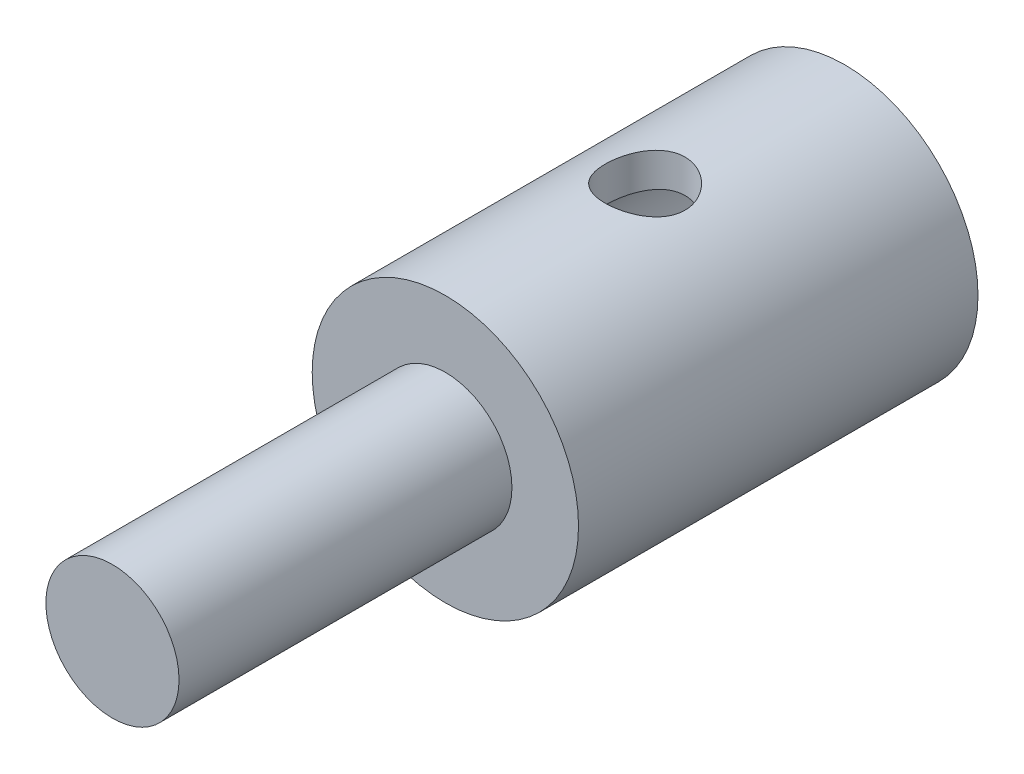
ISO-10303-21;
HEADER;
FILE_DESCRIPTION(('STEP AP214'),'2;1');
FILE_NAME('part.step','',(''),(''),'','','');
FILE_SCHEMA(('AUTOMOTIVE_DESIGN { 1 0 10303 214 1 1 1 1 }'));
ENDSEC;
DATA;
#1=APPLICATION_CONTEXT('core data for automotive mechanical design processes');
#2=APPLICATION_PROTOCOL_DEFINITION('international standard','automotive_design',2000,#1);
#3=PRODUCT_CONTEXT('',#1,'mechanical');
#4=PRODUCT('Part','Part','',(#3));
#5=PRODUCT_RELATED_PRODUCT_CATEGORY('part','',(#4));
#6=PRODUCT_DEFINITION_FORMATION('','',#4);
#7=PRODUCT_DEFINITION_CONTEXT('part definition',#1,'design');
#8=PRODUCT_DEFINITION('design','',#6,#7);
#9=PRODUCT_DEFINITION_SHAPE('','',#8);
#10=(LENGTH_UNIT() NAMED_UNIT(*) SI_UNIT(.MILLI.,.METRE.));
#11=(NAMED_UNIT(*) PLANE_ANGLE_UNIT() SI_UNIT($,.RADIAN.));
#12=(NAMED_UNIT(*) SI_UNIT($,.STERADIAN.) SOLID_ANGLE_UNIT());
#13=UNCERTAINTY_MEASURE_WITH_UNIT(LENGTH_MEASURE(1.E-05),#10,'distance_accuracy_value','');
#14=(GEOMETRIC_REPRESENTATION_CONTEXT(3) GLOBAL_UNCERTAINTY_ASSIGNED_CONTEXT((#13)) GLOBAL_UNIT_ASSIGNED_CONTEXT((#10,
#11,#12)) REPRESENTATION_CONTEXT('',''));
#15=CARTESIAN_POINT('',(0.,0.,0.));
#16=DIRECTION('',(0.,0.,1.));
#17=DIRECTION('',(1.,0.,0.));
#18=AXIS2_PLACEMENT_3D('',#15,#16,#17);
#19=CARTESIAN_POINT('',(0.,0.,5.5));
#20=DIRECTION('',(0.,0.,-1.));
#21=DIRECTION('',(-1.,0.,0.));
#22=AXIS2_PLACEMENT_3D('',#19,#20,#21);
#23=PLANE('',#22);
#24=CARTESIAN_POINT('',(0.,0.,5.5));
#25=DIRECTION('',(0.,0.,1.));
#26=DIRECTION('',(1.,0.,0.));
#27=AXIS2_PLACEMENT_3D('',#24,#25,#26);
#28=CIRCLE('',#27,1.);
#29=CARTESIAN_POINT('',(1.,0.,5.5));
#30=VERTEX_POINT('',#29);
#31=EDGE_CURVE('E10',#30,#30,#28,.T.);
#32=ORIENTED_EDGE('',*,*,#31,.T.);
#33=EDGE_LOOP('',(#32));
#34=FACE_BOUND('',#33,.T.);
#35=ADVANCED_FACE('F30',(#34),#23,.F.);
#36=CARTESIAN_POINT('',(0.,0.,5.5));
#37=DIRECTION('',(0.,0.,1.));
#38=DIRECTION('',(1.,0.,0.));
#39=AXIS2_PLACEMENT_3D('',#36,#37,#38);
#40=CYLINDRICAL_SURFACE('',#39,1.);
#41=ORIENTED_EDGE('',*,*,#31,.F.);
#42=EDGE_LOOP('',(#41));
#43=FACE_BOUND('',#42,.T.);
#44=CARTESIAN_POINT('',(0.,0.,0.5));
#45=DIRECTION('',(0.,0.,1.));
#46=DIRECTION('',(1.,0.,0.));
#47=AXIS2_PLACEMENT_3D('',#44,#45,#46);
#48=CIRCLE('',#47,1.);
#49=CARTESIAN_POINT('',(1.,0.,0.5));
#50=VERTEX_POINT('',#49);
#51=EDGE_CURVE('E42',#50,#50,#48,.T.);
#52=ORIENTED_EDGE('',*,*,#51,.T.);
#53=EDGE_LOOP('',(#52));
#54=FACE_BOUND('',#53,.T.);
#55=ADVANCED_FACE('F90',(#43,#54),#40,.T.);
#56=CARTESIAN_POINT('',(0.,1.,0.5));
#57=DIRECTION('',(0.,0.,-1.));
#58=DIRECTION('',(-1.,0.,0.));
#59=AXIS2_PLACEMENT_3D('',#56,#57,#58);
#60=PLANE('',#59);
#61=ORIENTED_EDGE('',*,*,#51,.F.);
#62=EDGE_LOOP('',(#61));
#63=FACE_BOUND('',#62,.T.);
#64=CARTESIAN_POINT('',(0.,0.,0.5));
#65=DIRECTION('',(0.,0.,1.));
#66=DIRECTION('',(1.,0.,0.));
#67=AXIS2_PLACEMENT_3D('',#64,#65,#66);
#68=CIRCLE('',#67,2.);
#69=CARTESIAN_POINT('',(2.,0.,0.5));
#70=VERTEX_POINT('',#69);
#71=EDGE_CURVE('E47',#70,#70,#68,.T.);
#72=ORIENTED_EDGE('',*,*,#71,.T.);
#73=EDGE_LOOP('',(#72));
#74=FACE_BOUND('',#73,.T.);
#75=ADVANCED_FACE('F86',(#63,#74),#60,.F.);
#76=CARTESIAN_POINT('',(0.,0.,5.5));
#77=DIRECTION('',(0.,0.,1.));
#78=DIRECTION('',(1.,0.,0.));
#79=AXIS2_PLACEMENT_3D('',#76,#77,#78);
#80=CYLINDRICAL_SURFACE('',#79,2.);
#81=CARTESIAN_POINT('',(0.,-2.,-1.9));
#82=CARTESIAN_POINT('',(0.03291544510132,-1.9999997170022,-1.90000039899395));
#83=CARTESIAN_POINT('',(0.0658349273406118,-1.99917966277583,-1.90271754544959));
#84=CARTESIAN_POINT('',(0.130715250121952,-1.99598842237475,-1.91348854168884));
#85=CARTESIAN_POINT('',(0.162675801764568,-1.99361677355871,-1.92154398320933));
#86=CARTESIAN_POINT('',(0.224693083101811,-1.9875822100074,-1.94269840676411));
#87=CARTESIAN_POINT('',(0.25475254575815,-1.98392120100191,-1.95578994784758));
#88=CARTESIAN_POINT('',(0.312249672421251,-1.97568843695037,-1.98661443722233));
#89=CARTESIAN_POINT('',(0.339686986987863,-1.97111656076748,-2.00434800295814));
#90=CARTESIAN_POINT('',(0.391948718873502,-1.96140294877191,-2.0444896029891));
#91=CARTESIAN_POINT('',(0.416687228497752,-1.9562495346312,-2.06700665035448));
#92=CARTESIAN_POINT('',(0.462099683693279,-1.94602333683871,-2.11584369196396));
#93=CARTESIAN_POINT('',(0.482772945309704,-1.94095056688659,-2.14216432484956));
#94=CARTESIAN_POINT('',(0.51992015089489,-1.93133645598676,-2.19858830121547));
#95=CARTESIAN_POINT('',(0.53628923608908,-1.92680962669952,-2.22876338439792));
#96=CARTESIAN_POINT('',(0.563685579098815,-1.91897448153211,-2.2915957016905));
#97=CARTESIAN_POINT('',(0.574714119679048,-1.91566587308889,-2.32425233756513));
#98=CARTESIAN_POINT('',(0.590806534730252,-1.91076348351385,-2.39015610645326));
#99=CARTESIAN_POINT('',(0.596028784940188,-1.90912427788711,-2.42336109755742));
#100=CARTESIAN_POINT('',(0.600854922460317,-1.90761115958514,-2.4902132625011));
#101=CARTESIAN_POINT('',(0.600460171044287,-1.90773681919679,-2.52386032722981));
#102=CARTESIAN_POINT('',(0.594187908798803,-1.90969897612233,-2.58935356344235));
#103=CARTESIAN_POINT('',(0.588508821050622,-1.91147355435668,-2.62122090014461));
#104=CARTESIAN_POINT('',(0.572149681708343,-1.91643342495439,-2.68352791450966));
#105=CARTESIAN_POINT('',(0.561469136566596,-1.91961885654016,-2.71396745094981));
#106=CARTESIAN_POINT('',(0.535264106614694,-1.92709093228899,-2.77304013986422));
#107=CARTESIAN_POINT('',(0.519675267738561,-1.93139206446088,-2.80164283358208));
#108=CARTESIAN_POINT('',(0.484140890354742,-1.94060394800318,-2.8558928088041));
#109=CARTESIAN_POINT('',(0.464194296010356,-1.94551484698876,-2.88153937176552));
#110=CARTESIAN_POINT('',(0.419525163062183,-1.95564404519092,-2.9302744763048));
#111=CARTESIAN_POINT('',(0.394637962986788,-1.96086661724177,-2.95321146561187));
#112=CARTESIAN_POINT('',(0.341305303725588,-1.97084897625326,-2.9946215936257));
#113=CARTESIAN_POINT('',(0.312859620744355,-1.9756087340737,-3.01309445136577));
#114=CARTESIAN_POINT('',(0.252942015337121,-1.98417264027782,-3.04514396898589));
#115=CARTESIAN_POINT('',(0.22145109989918,-1.98797017467324,-3.05868700649994));
#116=CARTESIAN_POINT('',(0.156498166241408,-1.9941340873289,-3.08023983603985));
#117=CARTESIAN_POINT('',(0.123036700635833,-1.996500864748,-3.088251171413));
#118=CARTESIAN_POINT('',(0.0563808970673328,-1.99947345857415,-3.09826087115976));
#119=CARTESIAN_POINT('',(0.0232200390404747,-2.00013940167117,-3.10046463432064));
#120=CARTESIAN_POINT('',(-0.0429998423293526,-1.99981169296703,-3.09937233771517));
#121=CARTESIAN_POINT('',(-0.0760588786763108,-1.99881826271098,-3.09607701213943));
#122=CARTESIAN_POINT('',(-0.14036144212388,-1.99532278794869,-3.0842461555554));
#123=CARTESIAN_POINT('',(-0.171629109045672,-1.99285531919782,-3.07583064496764));
#124=CARTESIAN_POINT('',(-0.232301855581804,-1.98669739136598,-3.05414270688873));
#125=CARTESIAN_POINT('',(-0.261706710810217,-1.98300678528377,-3.0408696955849));
#126=CARTESIAN_POINT('',(-0.318574875784438,-1.97467861740588,-3.0094987338075));
#127=CARTESIAN_POINT('',(-0.345977530479931,-1.97002112332088,-2.99129626362064));
#128=CARTESIAN_POINT('',(-0.397409323191996,-1.96029387505509,-2.95071009837904));
#129=CARTESIAN_POINT('',(-0.421437612942137,-1.95522401771617,-2.92832535524556));
#130=CARTESIAN_POINT('',(-0.466342978204352,-1.94501268748499,-2.87904507665161));
#131=CARTESIAN_POINT('',(-0.487073924926943,-1.93987530016511,-2.85201524968884));
#132=CARTESIAN_POINT('',(-0.523715980287685,-1.93030606092181,-2.79474882439705));
#133=CARTESIAN_POINT('',(-0.539627215314416,-1.92587419049889,-2.76451231018591));
#134=CARTESIAN_POINT('',(-0.566069388510893,-1.91826875857973,-2.7017870034919));
#135=CARTESIAN_POINT('',(-0.576625387759089,-1.91508935181965,-2.66930952535736));
#136=CARTESIAN_POINT('',(-0.592086923271644,-1.91036637789379,-2.60292481239779));
#137=CARTESIAN_POINT('',(-0.596994395917994,-1.90882225014947,-2.56901807167547));
#138=CARTESIAN_POINT('',(-0.600887937937676,-1.90759988987286,-2.5022553926552));
#139=CARTESIAN_POINT('',(-0.600112221233274,-1.90784658974116,-2.46941453959449));
#140=CARTESIAN_POINT('',(-0.593230021779939,-1.90999760518304,-2.40435435864936));
#141=CARTESIAN_POINT('',(-0.587123752499047,-1.91190185437816,-2.37213500592905));
#142=CARTESIAN_POINT('',(-0.569907555216364,-1.91710305467369,-2.30962184034326));
#143=CARTESIAN_POINT('',(-0.558860702028225,-1.92038241818175,-2.27930908505543));
#144=CARTESIAN_POINT('',(-0.532126028484565,-1.92796111563865,-2.2209430244728));
#145=CARTESIAN_POINT('',(-0.516437319851518,-1.93226064477782,-2.19289015294367));
#146=CARTESIAN_POINT('',(-0.480195055220275,-1.94159070570274,-2.13873475338919));
#147=CARTESIAN_POINT('',(-0.459485104371971,-1.94664216065503,-2.11274049549584));
#148=CARTESIAN_POINT('',(-0.414069738519131,-1.95680528180026,-2.06451900067685));
#149=CARTESIAN_POINT('',(-0.389363286853802,-1.96191696329566,-2.0422927442129));
#150=CARTESIAN_POINT('',(-0.335786304873299,-1.97180374628255,-2.00159063508199));
#151=CARTESIAN_POINT('',(-0.306815154316243,-1.97656463906268,-1.98324342125781));
#152=CARTESIAN_POINT('',(-0.246056549593412,-1.98504272182326,-1.95170593203839));
#153=CARTESIAN_POINT('',(-0.214270421199582,-1.98876039972427,-1.9385132446902));
#154=CARTESIAN_POINT('',(-0.152303085062113,-1.9944086998772,-1.9188418897389));
#155=CARTESIAN_POINT('',(-0.122314784781694,-1.99648810952427,-1.9117953308467));
#156=CARTESIAN_POINT('',(-0.0615520780923119,-1.99928377797797,-1.90237458990337));
#157=CARTESIAN_POINT('',(-0.0307778039432559,-2.00000026461896,-1.89999962691807));
#158=CARTESIAN_POINT('',(0.,-2.,-1.9));
#159=B_SPLINE_CURVE_WITH_KNOTS('',3,(#81,#82,#83,#84,#85,#86,#87,#88,#89,#90,#91,#92,#93,#94,
#95,#96,#97,#98,#99,#100,#101,#102,#103,#104,#105,#106,#107,#108,#109,#110,#111,#112,#113,#114,
#115,#116,#117,#118,#119,#120,#121,#122,#123,#124,#125,#126,#127,#128,#129,#130,#131,#132,#133,
#134,#135,#136,#137,#138,#139,#140,#141,#142,#143,#144,#145,#146,#147,#148,#149,#150,#151,#152,
#153,#154,#155,#156,#157,#158),.UNSPECIFIED.,.T.,.F.,(4,2,2,2,2,2,2,2,2,2,2,2,2,2,2,2,2,2,2,2,2,
2,2,2,2,2,2,2,2,2,2,2,2,2,2,2,2,2,4),(0.,0.0986332814450441,0.1972959859384,0.29581347052035,
0.39434406576508,0.495422411792766,0.596517749154532,0.699885924016436,0.803229258172894,
0.903678757411506,1.00410391324614,1.10090406676049,1.19771377460179,1.29584970575826,
1.39400944060401,1.49626841616245,1.59853382609407,1.70148418749654,1.80440581408502,
1.90363523772396,2.00285141417109,2.09982698669909,2.1968142183447,2.29604522278142,
2.39530112797055,2.49816160126106,2.60101937698051,2.70339125976521,2.80572803779072,
2.90380062181736,3.00186927859599,3.09872016156048,3.19558959016202,3.29598770266932,
3.3964118995396,3.49977198457628,3.60308364633053,3.69532676767143,3.78755446774509),.UNSPECIFIED.);
#160=CARTESIAN_POINT('',(0.,-2.,-1.9));
#161=VERTEX_POINT('',#160);
#162=EDGE_CURVE('E76',#161,#161,#159,.T.);
#163=ORIENTED_EDGE('',*,*,#162,.T.);
#164=EDGE_LOOP('',(#163));
#165=FACE_BOUND('',#164,.T.);
#166=CARTESIAN_POINT('',(0.,2.,-1.9));
#167=CARTESIAN_POINT('',(-0.03291544510132,1.9999997170022,-1.90000039899395));
#168=CARTESIAN_POINT('',(-0.0658349273406118,1.99917966277583,-1.90271754544959));
#169=CARTESIAN_POINT('',(-0.130715250121952,1.99598842237475,-1.91348854168884));
#170=CARTESIAN_POINT('',(-0.162675801764568,1.99361677355871,-1.92154398320933));
#171=CARTESIAN_POINT('',(-0.224693083101811,1.9875822100074,-1.94269840676411));
#172=CARTESIAN_POINT('',(-0.25475254575815,1.98392120100191,-1.95578994784758));
#173=CARTESIAN_POINT('',(-0.312249672421251,1.97568843695037,-1.98661443722233));
#174=CARTESIAN_POINT('',(-0.339686986987863,1.97111656076748,-2.00434800295814));
#175=CARTESIAN_POINT('',(-0.391948718873502,1.96140294877191,-2.0444896029891));
#176=CARTESIAN_POINT('',(-0.416687228497752,1.9562495346312,-2.06700665035448));
#177=CARTESIAN_POINT('',(-0.462099683693279,1.94602333683871,-2.11584369196396));
#178=CARTESIAN_POINT('',(-0.482772945309704,1.94095056688659,-2.14216432484956));
#179=CARTESIAN_POINT('',(-0.51992015089489,1.93133645598676,-2.19858830121547));
#180=CARTESIAN_POINT('',(-0.53628923608908,1.92680962669952,-2.22876338439792));
#181=CARTESIAN_POINT('',(-0.563685579098815,1.91897448153211,-2.2915957016905));
#182=CARTESIAN_POINT('',(-0.574714119679048,1.91566587308889,-2.32425233756513));
#183=CARTESIAN_POINT('',(-0.590806534730252,1.91076348351385,-2.39015610645326));
#184=CARTESIAN_POINT('',(-0.596028784940188,1.90912427788711,-2.42336109755742));
#185=CARTESIAN_POINT('',(-0.600854922460317,1.90761115958514,-2.4902132625011));
#186=CARTESIAN_POINT('',(-0.600460171044287,1.90773681919679,-2.52386032722981));
#187=CARTESIAN_POINT('',(-0.594187908798803,1.90969897612233,-2.58935356344235));
#188=CARTESIAN_POINT('',(-0.588508821050622,1.91147355435668,-2.62122090014461));
#189=CARTESIAN_POINT('',(-0.572149681708343,1.91643342495439,-2.68352791450966));
#190=CARTESIAN_POINT('',(-0.561469136566596,1.91961885654016,-2.71396745094981));
#191=CARTESIAN_POINT('',(-0.535264106614694,1.92709093228899,-2.77304013986422));
#192=CARTESIAN_POINT('',(-0.519675267738561,1.93139206446088,-2.80164283358208));
#193=CARTESIAN_POINT('',(-0.484140890354742,1.94060394800318,-2.8558928088041));
#194=CARTESIAN_POINT('',(-0.464194296010356,1.94551484698876,-2.88153937176552));
#195=CARTESIAN_POINT('',(-0.419525163062183,1.95564404519092,-2.9302744763048));
#196=CARTESIAN_POINT('',(-0.394637962986788,1.96086661724177,-2.95321146561187));
#197=CARTESIAN_POINT('',(-0.341305303725588,1.97084897625326,-2.9946215936257));
#198=CARTESIAN_POINT('',(-0.312859620744355,1.9756087340737,-3.01309445136577));
#199=CARTESIAN_POINT('',(-0.252942015337121,1.98417264027782,-3.04514396898589));
#200=CARTESIAN_POINT('',(-0.22145109989918,1.98797017467324,-3.05868700649994));
#201=CARTESIAN_POINT('',(-0.156498166241408,1.9941340873289,-3.08023983603985));
#202=CARTESIAN_POINT('',(-0.123036700635833,1.996500864748,-3.088251171413));
#203=CARTESIAN_POINT('',(-0.0563808970673328,1.99947345857415,-3.09826087115976));
#204=CARTESIAN_POINT('',(-0.0232200390404747,2.00013940167117,-3.10046463432064));
#205=CARTESIAN_POINT('',(0.0429998423293526,1.99981169296703,-3.09937233771517));
#206=CARTESIAN_POINT('',(0.0760588786763108,1.99881826271098,-3.09607701213943));
#207=CARTESIAN_POINT('',(0.14036144212388,1.99532278794869,-3.0842461555554));
#208=CARTESIAN_POINT('',(0.171629109045672,1.99285531919782,-3.07583064496764));
#209=CARTESIAN_POINT('',(0.232301855581804,1.98669739136598,-3.05414270688873));
#210=CARTESIAN_POINT('',(0.261706710810217,1.98300678528377,-3.0408696955849));
#211=CARTESIAN_POINT('',(0.318574875784438,1.97467861740588,-3.0094987338075));
#212=CARTESIAN_POINT('',(0.345977530479931,1.97002112332088,-2.99129626362064));
#213=CARTESIAN_POINT('',(0.397409323191996,1.96029387505509,-2.95071009837904));
#214=CARTESIAN_POINT('',(0.421437612942137,1.95522401771617,-2.92832535524556));
#215=CARTESIAN_POINT('',(0.466342978204352,1.94501268748499,-2.87904507665161));
#216=CARTESIAN_POINT('',(0.487073924926943,1.93987530016511,-2.85201524968884));
#217=CARTESIAN_POINT('',(0.523715980287685,1.93030606092181,-2.79474882439705));
#218=CARTESIAN_POINT('',(0.539627215314416,1.92587419049889,-2.76451231018591));
#219=CARTESIAN_POINT('',(0.566069388510893,1.91826875857973,-2.7017870034919));
#220=CARTESIAN_POINT('',(0.576625387759089,1.91508935181965,-2.66930952535736));
#221=CARTESIAN_POINT('',(0.592086923271644,1.91036637789379,-2.60292481239779));
#222=CARTESIAN_POINT('',(0.596994395917994,1.90882225014947,-2.56901807167547));
#223=CARTESIAN_POINT('',(0.600887937937676,1.90759988987286,-2.5022553926552));
#224=CARTESIAN_POINT('',(0.600112221233274,1.90784658974116,-2.46941453959449));
#225=CARTESIAN_POINT('',(0.593230021779939,1.90999760518304,-2.40435435864936));
#226=CARTESIAN_POINT('',(0.587123752499047,1.91190185437816,-2.37213500592905));
#227=CARTESIAN_POINT('',(0.569907555216364,1.91710305467369,-2.30962184034326));
#228=CARTESIAN_POINT('',(0.558860702028225,1.92038241818175,-2.27930908505543));
#229=CARTESIAN_POINT('',(0.532126028484565,1.92796111563865,-2.2209430244728));
#230=CARTESIAN_POINT('',(0.516437319851518,1.93226064477782,-2.19289015294367));
#231=CARTESIAN_POINT('',(0.480195055220275,1.94159070570274,-2.13873475338919));
#232=CARTESIAN_POINT('',(0.459485104371971,1.94664216065503,-2.11274049549584));
#233=CARTESIAN_POINT('',(0.414069738519131,1.95680528180026,-2.06451900067685));
#234=CARTESIAN_POINT('',(0.389363286853802,1.96191696329566,-2.0422927442129));
#235=CARTESIAN_POINT('',(0.335786304873299,1.97180374628255,-2.00159063508199));
#236=CARTESIAN_POINT('',(0.306815154316243,1.97656463906268,-1.98324342125781));
#237=CARTESIAN_POINT('',(0.246056549593412,1.98504272182326,-1.95170593203839));
#238=CARTESIAN_POINT('',(0.214270421199582,1.98876039972427,-1.9385132446902));
#239=CARTESIAN_POINT('',(0.152303085062113,1.9944086998772,-1.9188418897389));
#240=CARTESIAN_POINT('',(0.122314784781694,1.99648810952427,-1.9117953308467));
#241=CARTESIAN_POINT('',(0.0615520780923119,1.99928377797797,-1.90237458990337));
#242=CARTESIAN_POINT('',(0.0307778039432559,2.00000026461896,-1.89999962691807));
#243=CARTESIAN_POINT('',(0.,2.,-1.9));
#244=B_SPLINE_CURVE_WITH_KNOTS('',3,(#166,#167,#168,#169,#170,#171,#172,#173,#174,#175,#176,
#177,#178,#179,#180,#181,#182,#183,#184,#185,#186,#187,#188,#189,#190,#191,#192,#193,#194,#195,
#196,#197,#198,#199,#200,#201,#202,#203,#204,#205,#206,#207,#208,#209,#210,#211,#212,#213,#214,
#215,#216,#217,#218,#219,#220,#221,#222,#223,#224,#225,#226,#227,#228,#229,#230,#231,#232,#233,
#234,#235,#236,#237,#238,#239,#240,#241,#242,#243),.UNSPECIFIED.,.T.,.F.,(4,2,2,2,2,2,2,2,2,2,2,
2,2,2,2,2,2,2,2,2,2,2,2,2,2,2,2,2,2,2,2,2,2,2,2,2,2,2,4),(0.,0.0986332814450441,0.1972959859384,
0.29581347052035,0.39434406576508,0.495422411792766,0.596517749154532,0.699885924016436,
0.803229258172894,0.903678757411506,1.00410391324614,1.10090406676049,1.19771377460179,
1.29584970575826,1.39400944060401,1.49626841616245,1.59853382609407,1.70148418749654,
1.80440581408502,1.90363523772396,2.00285141417109,2.09982698669909,2.1968142183447,
2.29604522278142,2.39530112797055,2.49816160126106,2.60101937698051,2.70339125976521,
2.80572803779072,2.90380062181736,3.00186927859599,3.09872016156048,3.19558959016202,
3.29598770266932,3.3964118995396,3.49977198457628,3.60308364633053,3.69532676767143,
3.78755446774509),.UNSPECIFIED.);
#245=CARTESIAN_POINT('',(0.,2.,-1.9));
#246=VERTEX_POINT('',#245);
#247=EDGE_CURVE('E70',#246,#246,#244,.T.);
#248=ORIENTED_EDGE('',*,*,#247,.T.);
#249=EDGE_LOOP('',(#248));
#250=FACE_BOUND('',#249,.T.);
#251=ORIENTED_EDGE('',*,*,#71,.F.);
#252=EDGE_LOOP('',(#251));
#253=FACE_BOUND('',#252,.T.);
#254=CARTESIAN_POINT('',(0.,0.,-5.5));
#255=DIRECTION('',(0.,0.,1.));
#256=DIRECTION('',(1.,0.,0.));
#257=AXIS2_PLACEMENT_3D('',#254,#255,#256);
#258=CIRCLE('',#257,2.);
#259=CARTESIAN_POINT('',(2.,0.,-5.5));
#260=VERTEX_POINT('',#259);
#261=EDGE_CURVE('E103',#260,#260,#258,.T.);
#262=ORIENTED_EDGE('',*,*,#261,.T.);
#263=EDGE_LOOP('',(#262));
#264=FACE_BOUND('',#263,.T.);
#265=ADVANCED_FACE('F81',(#165,#250,#253,#264),#80,.T.);
#266=CARTESIAN_POINT('',(0.,2.,-5.5));
#267=DIRECTION('',(0.,0.,1.));
#268=DIRECTION('',(1.,0.,0.));
#269=AXIS2_PLACEMENT_3D('',#266,#267,#268);
#270=PLANE('',#269);
#271=ORIENTED_EDGE('',*,*,#261,.F.);
#272=EDGE_LOOP('',(#271));
#273=FACE_BOUND('',#272,.T.);
#274=CARTESIAN_POINT('',(0.,0.,-5.5));
#275=DIRECTION('',(0.,0.,1.));
#276=DIRECTION('',(1.,0.,0.));
#277=AXIS2_PLACEMENT_3D('',#274,#275,#276);
#278=CIRCLE('',#277,1.5);
#279=CARTESIAN_POINT('',(1.5,0.,-5.5));
#280=VERTEX_POINT('',#279);
#281=EDGE_CURVE('E105',#280,#280,#278,.T.);
#282=ORIENTED_EDGE('',*,*,#281,.T.);
#283=EDGE_LOOP('',(#282));
#284=FACE_BOUND('',#283,.T.);
#285=ADVANCED_FACE('F85',(#273,#284),#270,.F.);
#286=CARTESIAN_POINT('',(0.,0.,5.5));
#287=DIRECTION('',(0.,0.,1.));
#288=DIRECTION('',(1.,0.,0.));
#289=AXIS2_PLACEMENT_3D('',#286,#287,#288);
#290=CYLINDRICAL_SURFACE('',#289,1.5);
#291=CARTESIAN_POINT('',(0.,-1.5,-1.9));
#292=CARTESIAN_POINT('',(-0.0322479016328674,-1.49999781368125,-1.90000295554712));
#293=CARTESIAN_POINT('',(-0.0645517692272019,-1.4989478829208,-1.90261532562651));
#294=CARTESIAN_POINT('',(-0.128248944125369,-1.49485035930193,-1.91297431105637));
#295=CARTESIAN_POINT('',(-0.159639533268374,-1.49179733609663,-1.92073488372584));
#296=CARTESIAN_POINT('',(-0.220486176818221,-1.48402262763936,-1.94106282341765));
#297=CARTESIAN_POINT('',(-0.249948198485087,-1.47930640909222,-1.95361445386502));
#298=CARTESIAN_POINT('',(-0.30632159109851,-1.46866983238823,-1.98310575199796));
#299=CARTESIAN_POINT('',(-0.333233843025297,-1.46274989237417,-2.00004389647568));
#300=CARTESIAN_POINT('',(-0.385050302271118,-1.44999265851126,-2.03867064956828));
#301=CARTESIAN_POINT('',(-0.409818681765064,-1.44312689078757,-2.06053199687208));
#302=CARTESIAN_POINT('',(-0.455452501435416,-1.42938173071858,-2.10802000104303));
#303=CARTESIAN_POINT('',(-0.476316032140059,-1.42250233336138,-2.13364848916352));
#304=CARTESIAN_POINT('',(-0.514462370187863,-1.40916837539141,-2.18932842107268));
#305=CARTESIAN_POINT('',(-0.531544494358642,-1.40274634789485,-2.21952594580696));
#306=CARTESIAN_POINT('',(-0.560326415711144,-1.39150094156038,-2.28266091952601));
#307=CARTESIAN_POINT('',(-0.57202876928575,-1.38667680373253,-2.31559705835451));
#308=CARTESIAN_POINT('',(-0.58916964701876,-1.37947907298246,-2.38171370007763));
#309=CARTESIAN_POINT('',(-0.594868189741694,-1.37700426106682,-2.41481537067286));
#310=CARTESIAN_POINT('',(-0.600651888492009,-1.37449201214743,-2.48159049949218));
#311=CARTESIAN_POINT('',(-0.600739804893967,-1.37445337656831,-2.5152636683875));
#312=CARTESIAN_POINT('',(-0.595496810251363,-1.37673150083998,-2.57972700143741));
#313=CARTESIAN_POINT('',(-0.590542594291541,-1.37888452511535,-2.61055471432271));
#314=CARTESIAN_POINT('',(-0.575984064089346,-1.38502856282351,-2.67089786680201));
#315=CARTESIAN_POINT('',(-0.566378938441389,-1.38901989696502,-2.70041307643309));
#316=CARTESIAN_POINT('',(-0.542608419765322,-1.39847845526559,-2.75800535085881));
#317=CARTESIAN_POINT('',(-0.528353958694595,-1.40397413784236,-2.78604077171641));
#318=CARTESIAN_POINT('',(-0.495751938219664,-1.41581434916967,-2.83942474490847));
#319=CARTESIAN_POINT('',(-0.477402841530253,-1.42215919637055,-2.86477228282084));
#320=CARTESIAN_POINT('',(-0.43546517983633,-1.43558021022681,-2.9141229186406));
#321=CARTESIAN_POINT('',(-0.411581238891191,-1.44267499492846,-2.9378706188338));
#322=CARTESIAN_POINT('',(-0.360094328229058,-1.45637947487485,-2.98110534340061));
#323=CARTESIAN_POINT('',(-0.33249061960033,-1.46298907333597,-3.00059151922309));
#324=CARTESIAN_POINT('',(-0.273623295781753,-1.47514404379365,-3.03508523422475));
#325=CARTESIAN_POINT('',(-0.242298147403943,-1.48066581028625,-3.04999668435912));
#326=CARTESIAN_POINT('',(-0.177307129644865,-1.48984448498628,-3.07425035832342));
#327=CARTESIAN_POINT('',(-0.143642459054903,-1.49350234038714,-3.08359541126722));
#328=CARTESIAN_POINT('',(-0.0770687662823457,-1.49836841852074,-3.09593448862591));
#329=CARTESIAN_POINT('',(-0.0442329881956591,-1.49970883750057,-3.09927173627606));
#330=CARTESIAN_POINT('',(0.0215535929423437,-1.50020543553187,-3.10051393015859));
#331=CARTESIAN_POINT('',(0.0545043639671719,-1.49936218074679,-3.09842028446426));
#332=CARTESIAN_POINT('',(0.118029821736601,-1.49567270119134,-3.08911247423439));
#333=CARTESIAN_POINT('',(0.14864474753266,-1.49291817403686,-3.08213260589467));
#334=CARTESIAN_POINT('',(0.208240628418216,-1.48577832421621,-3.06356928750709));
#335=CARTESIAN_POINT('',(0.237221373067387,-1.4813927920685,-3.05198524609952));
#336=CARTESIAN_POINT('',(0.293723635745078,-1.47124978431356,-3.02416451809588));
#337=CARTESIAN_POINT('',(0.321173406826879,-1.46545444794366,-3.00779635838655));
#338=CARTESIAN_POINT('',(0.373033077373709,-1.45312009423233,-2.97101790282881));
#339=CARTESIAN_POINT('',(0.397441752227376,-1.44658077931494,-2.9506059871251));
#340=CARTESIAN_POINT('',(0.44421691290967,-1.43293535293125,-2.9047389961131));
#341=CARTESIAN_POINT('',(0.46634218014576,-1.42582032434024,-2.87903993754041));
#342=CARTESIAN_POINT('',(0.506025359220172,-1.4122250186863,-2.82416797510492));
#343=CARTESIAN_POINT('',(0.52358251838651,-1.40574484633605,-2.79499449992693));
#344=CARTESIAN_POINT('',(0.553742250590837,-1.39414289997032,-2.73356149159978));
#345=CARTESIAN_POINT('',(0.56629517841029,-1.3890348935785,-2.70127480014192));
#346=CARTESIAN_POINT('',(0.585688865962333,-1.38097102135267,-2.63477990438705));
#347=CARTESIAN_POINT('',(0.592533841593995,-1.37801356732559,-2.60057313822623));
#348=CARTESIAN_POINT('',(0.599914685172235,-1.37481527767886,-2.53386162948679));
#349=CARTESIAN_POINT('',(0.60086912468784,-1.3743942629654,-2.50141154812712));
#350=CARTESIAN_POINT('',(0.597540947786276,-1.3758445081584,-2.43683654268089));
#351=CARTESIAN_POINT('',(0.593258996374929,-1.37771547698992,-2.40471157782788));
#352=CARTESIAN_POINT('',(0.579921409845332,-1.38337994722213,-2.34300034304478));
#353=CARTESIAN_POINT('',(0.571061248071088,-1.38709449547834,-2.31336391767045));
#354=CARTESIAN_POINT('',(0.549001634547508,-1.3959720037021,-2.25598641111561));
#355=CARTESIAN_POINT('',(0.5358009844182,-1.40113536361912,-2.22824585592996));
#356=CARTESIAN_POINT('',(0.504561828827859,-1.41269582881231,-2.17371711421887));
#357=CARTESIAN_POINT('',(0.486289600547831,-1.41914664693941,-2.14707439896088));
#358=CARTESIAN_POINT('',(0.445767635781465,-1.43239141311703,-2.09710200483885));
#359=CARTESIAN_POINT('',(0.423516700445441,-1.43918546414531,-2.0737733283615));
#360=CARTESIAN_POINT('',(0.373951651881734,-1.45288070126209,-2.02953914402092));
#361=CARTESIAN_POINT('',(0.34640280034384,-1.45976027388653,-2.00888880793058));
#362=CARTESIAN_POINT('',(0.287970096085735,-1.47240122014118,-1.97249888721351));
#363=CARTESIAN_POINT('',(0.257084701364172,-1.47816207327873,-1.95676158635424));
#364=CARTESIAN_POINT('',(0.193421418748561,-1.48781914444758,-1.93101333544291));
#365=CARTESIAN_POINT('',(0.160689485465909,-1.49174808916508,-1.9209012029319));
#366=CARTESIAN_POINT('',(0.0938629638843664,-1.4974329186281,-1.90640826371372));
#367=CARTESIAN_POINT('',(0.0597730577576739,-1.49919569848691,-1.90200926897683));
#368=CARTESIAN_POINT('',(0.0170736893672789,-1.49992769851241,-1.90018138570652));
#369=CARTESIAN_POINT('',(0.00853880662222754,-1.50000057890753,-1.89999921741124));
#370=CARTESIAN_POINT('',(0.,-1.5,-1.9));
#371=B_SPLINE_CURVE_WITH_KNOTS('',3,(#291,#292,#293,#294,#295,#296,#297,#298,#299,#300,#301,
#302,#303,#304,#305,#306,#307,#308,#309,#310,#311,#312,#313,#314,#315,#316,#317,#318,#319,#320,
#321,#322,#323,#324,#325,#326,#327,#328,#329,#330,#331,#332,#333,#334,#335,#336,#337,#338,#339,
#340,#341,#342,#343,#344,#345,#346,#347,#348,#349,#350,#351,#352,#353,#354,#355,#356,#357,#358,
#359,#360,#361,#362,#363,#364,#365,#366,#367,#368,#369,#370),.UNSPECIFIED.,.T.,.F.,(4,2,2,2,2,2,
2,2,2,2,2,2,2,2,2,2,2,2,2,2,2,2,2,2,2,2,2,2,2,2,2,2,2,2,2,2,2,2,2,4),(0.,0.0967208963679212,
0.19370509080238,0.290373437241474,0.387008260703952,0.487792145101191,0.588625184803234,
0.69394577645765,0.799216269354804,0.899712315926485,1.00015891902146,1.09361498520412,
1.18708736176814,1.28246737889645,1.37788326581455,1.48067504755967,1.5834872785192,
1.68833073948842,1.79312086834137,1.89170755358402,1.99026868071025,2.0844013666931,
2.17854614698139,2.27557054019479,2.37263387849691,2.47610542387324,2.57959400713124,
2.68408513539809,2.78849901788503,2.88539902012547,2.98228671763636,3.07534295559353,
3.16842490736271,3.2668364041173,3.36527760399241,3.47010127054873,3.57497359086883,
3.67789290298718,3.78048375716025,3.80609413763761),.UNSPECIFIED.);
#372=CARTESIAN_POINT('',(0.,-1.5,-1.9));
#373=VERTEX_POINT('',#372);
#374=EDGE_CURVE('E33',#373,#373,#371,.T.);
#375=ORIENTED_EDGE('',*,*,#374,.T.);
#376=EDGE_LOOP('',(#375));
#377=FACE_BOUND('',#376,.T.);
#378=CARTESIAN_POINT('',(0.,1.5,-1.9));
#379=CARTESIAN_POINT('',(0.0322479016328674,1.49999781368125,-1.90000295554712));
#380=CARTESIAN_POINT('',(0.0645517692272019,1.4989478829208,-1.90261532562651));
#381=CARTESIAN_POINT('',(0.128248944125369,1.49485035930193,-1.91297431105637));
#382=CARTESIAN_POINT('',(0.159639533268374,1.49179733609663,-1.92073488372584));
#383=CARTESIAN_POINT('',(0.220486176818221,1.48402262763936,-1.94106282341765));
#384=CARTESIAN_POINT('',(0.249948198485087,1.47930640909222,-1.95361445386502));
#385=CARTESIAN_POINT('',(0.30632159109851,1.46866983238823,-1.98310575199796));
#386=CARTESIAN_POINT('',(0.333233843025297,1.46274989237417,-2.00004389647568));
#387=CARTESIAN_POINT('',(0.385050302271118,1.44999265851126,-2.03867064956828));
#388=CARTESIAN_POINT('',(0.409818681765064,1.44312689078757,-2.06053199687208));
#389=CARTESIAN_POINT('',(0.455452501435416,1.42938173071858,-2.10802000104303));
#390=CARTESIAN_POINT('',(0.476316032140059,1.42250233336138,-2.13364848916352));
#391=CARTESIAN_POINT('',(0.514462370187863,1.40916837539141,-2.18932842107268));
#392=CARTESIAN_POINT('',(0.531544494358642,1.40274634789485,-2.21952594580696));
#393=CARTESIAN_POINT('',(0.560326415711144,1.39150094156038,-2.28266091952601));
#394=CARTESIAN_POINT('',(0.57202876928575,1.38667680373253,-2.31559705835451));
#395=CARTESIAN_POINT('',(0.58916964701876,1.37947907298246,-2.38171370007763));
#396=CARTESIAN_POINT('',(0.594868189741694,1.37700426106682,-2.41481537067286));
#397=CARTESIAN_POINT('',(0.600651888492009,1.37449201214743,-2.48159049949218));
#398=CARTESIAN_POINT('',(0.600739804893967,1.37445337656831,-2.5152636683875));
#399=CARTESIAN_POINT('',(0.595496810251363,1.37673150083998,-2.57972700143741));
#400=CARTESIAN_POINT('',(0.590542594291541,1.37888452511535,-2.61055471432271));
#401=CARTESIAN_POINT('',(0.575984064089346,1.38502856282351,-2.67089786680201));
#402=CARTESIAN_POINT('',(0.566378938441389,1.38901989696502,-2.70041307643309));
#403=CARTESIAN_POINT('',(0.542608419765322,1.39847845526559,-2.75800535085881));
#404=CARTESIAN_POINT('',(0.528353958694595,1.40397413784236,-2.78604077171641));
#405=CARTESIAN_POINT('',(0.495751938219664,1.41581434916967,-2.83942474490847));
#406=CARTESIAN_POINT('',(0.477402841530253,1.42215919637055,-2.86477228282084));
#407=CARTESIAN_POINT('',(0.43546517983633,1.43558021022681,-2.9141229186406));
#408=CARTESIAN_POINT('',(0.411581238891191,1.44267499492846,-2.9378706188338));
#409=CARTESIAN_POINT('',(0.360094328229058,1.45637947487485,-2.98110534340061));
#410=CARTESIAN_POINT('',(0.33249061960033,1.46298907333597,-3.00059151922309));
#411=CARTESIAN_POINT('',(0.273623295781753,1.47514404379365,-3.03508523422475));
#412=CARTESIAN_POINT('',(0.242298147403943,1.48066581028625,-3.04999668435912));
#413=CARTESIAN_POINT('',(0.177307129644865,1.48984448498628,-3.07425035832342));
#414=CARTESIAN_POINT('',(0.143642459054903,1.49350234038714,-3.08359541126722));
#415=CARTESIAN_POINT('',(0.0770687662823457,1.49836841852074,-3.09593448862591));
#416=CARTESIAN_POINT('',(0.0442329881956591,1.49970883750057,-3.09927173627606));
#417=CARTESIAN_POINT('',(-0.0215535929423437,1.50020543553187,-3.10051393015859));
#418=CARTESIAN_POINT('',(-0.0545043639671719,1.49936218074679,-3.09842028446426));
#419=CARTESIAN_POINT('',(-0.118029821736601,1.49567270119134,-3.08911247423439));
#420=CARTESIAN_POINT('',(-0.14864474753266,1.49291817403686,-3.08213260589467));
#421=CARTESIAN_POINT('',(-0.208240628418216,1.48577832421621,-3.06356928750709));
#422=CARTESIAN_POINT('',(-0.237221373067387,1.4813927920685,-3.05198524609952));
#423=CARTESIAN_POINT('',(-0.293723635745078,1.47124978431356,-3.02416451809588));
#424=CARTESIAN_POINT('',(-0.321173406826879,1.46545444794366,-3.00779635838655));
#425=CARTESIAN_POINT('',(-0.373033077373709,1.45312009423233,-2.97101790282881));
#426=CARTESIAN_POINT('',(-0.397441752227376,1.44658077931494,-2.9506059871251));
#427=CARTESIAN_POINT('',(-0.44421691290967,1.43293535293125,-2.9047389961131));
#428=CARTESIAN_POINT('',(-0.46634218014576,1.42582032434024,-2.87903993754041));
#429=CARTESIAN_POINT('',(-0.506025359220172,1.4122250186863,-2.82416797510492));
#430=CARTESIAN_POINT('',(-0.52358251838651,1.40574484633605,-2.79499449992693));
#431=CARTESIAN_POINT('',(-0.553742250590837,1.39414289997032,-2.73356149159978));
#432=CARTESIAN_POINT('',(-0.56629517841029,1.3890348935785,-2.70127480014192));
#433=CARTESIAN_POINT('',(-0.585688865962333,1.38097102135267,-2.63477990438705));
#434=CARTESIAN_POINT('',(-0.592533841593995,1.37801356732559,-2.60057313822623));
#435=CARTESIAN_POINT('',(-0.599914685172235,1.37481527767886,-2.53386162948679));
#436=CARTESIAN_POINT('',(-0.60086912468784,1.3743942629654,-2.50141154812712));
#437=CARTESIAN_POINT('',(-0.597540947786276,1.3758445081584,-2.43683654268089));
#438=CARTESIAN_POINT('',(-0.593258996374929,1.37771547698992,-2.40471157782788));
#439=CARTESIAN_POINT('',(-0.579921409845332,1.38337994722213,-2.34300034304478));
#440=CARTESIAN_POINT('',(-0.571061248071088,1.38709449547834,-2.31336391767045));
#441=CARTESIAN_POINT('',(-0.549001634547508,1.3959720037021,-2.25598641111561));
#442=CARTESIAN_POINT('',(-0.5358009844182,1.40113536361912,-2.22824585592996));
#443=CARTESIAN_POINT('',(-0.504561828827859,1.41269582881231,-2.17371711421887));
#444=CARTESIAN_POINT('',(-0.486289600547831,1.41914664693941,-2.14707439896088));
#445=CARTESIAN_POINT('',(-0.445767635781465,1.43239141311703,-2.09710200483885));
#446=CARTESIAN_POINT('',(-0.423516700445441,1.43918546414531,-2.0737733283615));
#447=CARTESIAN_POINT('',(-0.373951651881734,1.45288070126209,-2.02953914402092));
#448=CARTESIAN_POINT('',(-0.34640280034384,1.45976027388653,-2.00888880793058));
#449=CARTESIAN_POINT('',(-0.287970096085735,1.47240122014118,-1.97249888721351));
#450=CARTESIAN_POINT('',(-0.257084701364172,1.47816207327873,-1.95676158635424));
#451=CARTESIAN_POINT('',(-0.193421418748561,1.48781914444758,-1.93101333544291));
#452=CARTESIAN_POINT('',(-0.160689485465909,1.49174808916508,-1.9209012029319));
#453=CARTESIAN_POINT('',(-0.0938629638843664,1.4974329186281,-1.90640826371372));
#454=CARTESIAN_POINT('',(-0.0597730577576739,1.49919569848691,-1.90200926897683));
#455=CARTESIAN_POINT('',(-0.0170736893672789,1.49992769851241,-1.90018138570652));
#456=CARTESIAN_POINT('',(-0.00853880662222754,1.50000057890753,-1.89999921741124));
#457=CARTESIAN_POINT('',(0.,1.5,-1.9));
#458=B_SPLINE_CURVE_WITH_KNOTS('',3,(#378,#379,#380,#381,#382,#383,#384,#385,#386,#387,#388,
#389,#390,#391,#392,#393,#394,#395,#396,#397,#398,#399,#400,#401,#402,#403,#404,#405,#406,#407,
#408,#409,#410,#411,#412,#413,#414,#415,#416,#417,#418,#419,#420,#421,#422,#423,#424,#425,#426,
#427,#428,#429,#430,#431,#432,#433,#434,#435,#436,#437,#438,#439,#440,#441,#442,#443,#444,#445,
#446,#447,#448,#449,#450,#451,#452,#453,#454,#455,#456,#457),.UNSPECIFIED.,.T.,.F.,(4,2,2,2,2,2,
2,2,2,2,2,2,2,2,2,2,2,2,2,2,2,2,2,2,2,2,2,2,2,2,2,2,2,2,2,2,2,2,2,4),(0.,0.0967208963679212,
0.19370509080238,0.290373437241474,0.387008260703952,0.487792145101191,0.588625184803234,
0.69394577645765,0.799216269354804,0.899712315926485,1.00015891902146,1.09361498520412,
1.18708736176814,1.28246737889645,1.37788326581455,1.48067504755967,1.5834872785192,
1.68833073948842,1.79312086834137,1.89170755358402,1.99026868071025,2.0844013666931,
2.17854614698139,2.27557054019479,2.37263387849691,2.47610542387324,2.57959400713124,
2.68408513539809,2.78849901788503,2.88539902012547,2.98228671763636,3.07534295559353,
3.16842490736271,3.2668364041173,3.36527760399241,3.47010127054873,3.57497359086883,
3.67789290298718,3.78048375716025,3.80609413763761),.UNSPECIFIED.);
#459=CARTESIAN_POINT('',(0.,1.5,-1.9));
#460=VERTEX_POINT('',#459);
#461=EDGE_CURVE('E50',#460,#460,#458,.T.);
#462=ORIENTED_EDGE('',*,*,#461,.T.);
#463=EDGE_LOOP('',(#462));
#464=FACE_BOUND('',#463,.T.);
#465=ORIENTED_EDGE('',*,*,#281,.F.);
#466=EDGE_LOOP('',(#465));
#467=FACE_BOUND('',#466,.T.);
#468=CARTESIAN_POINT('',(0.,0.,-1.5));
#469=DIRECTION('',(0.,0.,1.));
#470=DIRECTION('',(1.,0.,0.));
#471=AXIS2_PLACEMENT_3D('',#468,#469,#470);
#472=CIRCLE('',#471,1.5);
#473=CARTESIAN_POINT('',(1.5,0.,-1.5));
#474=VERTEX_POINT('',#473);
#475=EDGE_CURVE('E109',#474,#474,#472,.T.);
#476=ORIENTED_EDGE('',*,*,#475,.T.);
#477=EDGE_LOOP('',(#476));
#478=FACE_BOUND('',#477,.T.);
#479=ADVANCED_FACE('F55',(#377,#464,#467,#478),#290,.F.);
#480=CARTESIAN_POINT('',(0.,1.5,-1.5));
#481=DIRECTION('',(0.,0.,1.));
#482=DIRECTION('',(1.,0.,0.));
#483=AXIS2_PLACEMENT_3D('',#480,#481,#482);
#484=PLANE('',#483);
#485=ORIENTED_EDGE('',*,*,#475,.F.);
#486=EDGE_LOOP('',(#485));
#487=FACE_BOUND('',#486,.T.);
#488=ADVANCED_FACE('F64',(#487),#484,.F.);
#489=CARTESIAN_POINT('',(0.,-2.,-2.5));
#490=DIRECTION('',(0.,1.,0.));
#491=DIRECTION('',(0.,0.,1.));
#492=AXIS2_PLACEMENT_3D('',#489,#490,#491);
#493=CYLINDRICAL_SURFACE('',#492,0.6);
#494=ORIENTED_EDGE('',*,*,#461,.F.);
#495=EDGE_LOOP('',(#494));
#496=FACE_BOUND('',#495,.T.);
#497=ORIENTED_EDGE('',*,*,#247,.F.);
#498=EDGE_LOOP('',(#497));
#499=FACE_BOUND('',#498,.T.);
#500=ADVANCED_FACE('F62',(#496,#499),#493,.F.);
#501=ORIENTED_EDGE('',*,*,#374,.F.);
#502=EDGE_LOOP('',(#501));
#503=FACE_BOUND('',#502,.T.);
#504=ORIENTED_EDGE('',*,*,#162,.F.);
#505=EDGE_LOOP('',(#504));
#506=FACE_BOUND('',#505,.T.);
#507=ADVANCED_FACE('F59',(#503,#506),#493,.F.);
#508=CLOSED_SHELL('',(#35,#55,#75,#265,#285,#479,#488,#500,#507));
#509=MANIFOLD_SOLID_BREP('B2',#508);
#510=ADVANCED_BREP_SHAPE_REPRESENTATION('',(#18,#509),#14);
#511=SHAPE_DEFINITION_REPRESENTATION(#9,#510);
ENDSEC;
END-ISO-10303-21;
